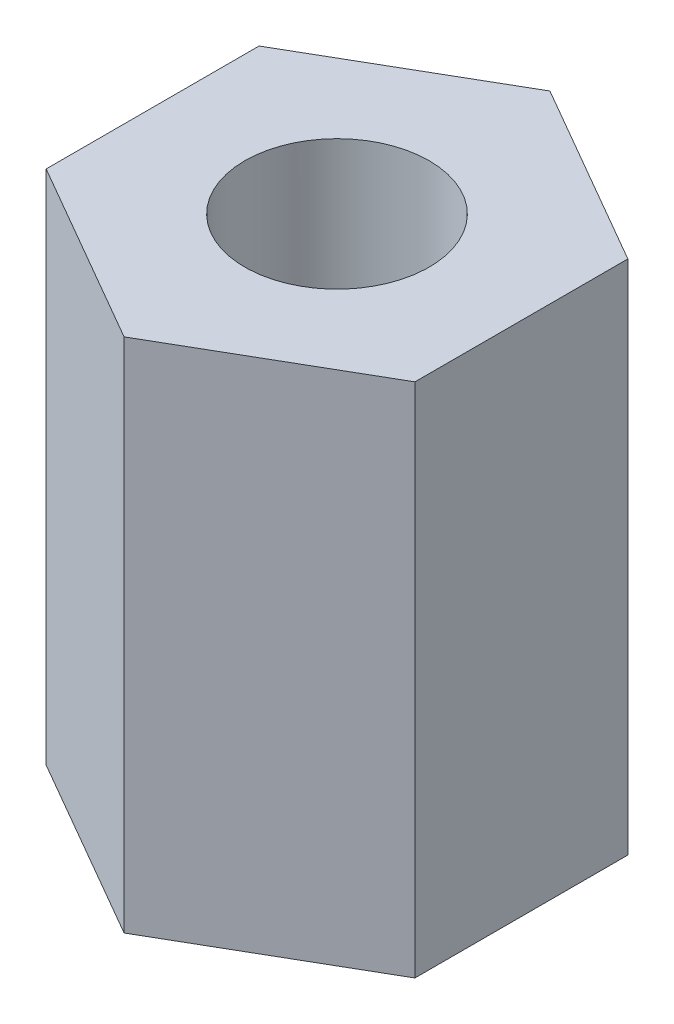
ISO-10303-21;
HEADER;
FILE_DESCRIPTION(('STEP AP214'),'2;1');
FILE_NAME('part.step','',(''),(''),'','','');
FILE_SCHEMA(('AUTOMOTIVE_DESIGN { 1 0 10303 214 1 1 1 1 }'));
ENDSEC;
DATA;
#1=APPLICATION_CONTEXT('core data for automotive mechanical design processes');
#2=APPLICATION_PROTOCOL_DEFINITION('international standard','automotive_design',2000,#1);
#3=PRODUCT_CONTEXT('',#1,'mechanical');
#4=PRODUCT('Part','Part','',(#3));
#5=PRODUCT_RELATED_PRODUCT_CATEGORY('part','',(#4));
#6=PRODUCT_DEFINITION_FORMATION('','',#4);
#7=PRODUCT_DEFINITION_CONTEXT('part definition',#1,'design');
#8=PRODUCT_DEFINITION('design','',#6,#7);
#9=PRODUCT_DEFINITION_SHAPE('','',#8);
#10=(LENGTH_UNIT() NAMED_UNIT(*) SI_UNIT(.MILLI.,.METRE.));
#11=(NAMED_UNIT(*) PLANE_ANGLE_UNIT() SI_UNIT($,.RADIAN.));
#12=(NAMED_UNIT(*) SI_UNIT($,.STERADIAN.) SOLID_ANGLE_UNIT());
#13=UNCERTAINTY_MEASURE_WITH_UNIT(LENGTH_MEASURE(1.E-05),#10,'distance_accuracy_value','');
#14=(GEOMETRIC_REPRESENTATION_CONTEXT(3) GLOBAL_UNCERTAINTY_ASSIGNED_CONTEXT((#13)) GLOBAL_UNIT_ASSIGNED_CONTEXT((#10,
#11,#12)) REPRESENTATION_CONTEXT('',''));
#15=CARTESIAN_POINT('',(0.,0.,0.));
#16=DIRECTION('',(0.,0.,1.));
#17=DIRECTION('',(1.,0.,0.));
#18=AXIS2_PLACEMENT_3D('',#15,#16,#17);
#19=CARTESIAN_POINT('',(2.5,0.,-1.443375672974));
#20=DIRECTION('',(0.500000000000017,0.,-0.866025403784429));
#21=DIRECTION('',(0.,-1.,0.));
#22=AXIS2_PLACEMENT_3D('',#19,#20,#21);
#23=PLANE('',#22);
#24=DIRECTION('',(0.,1.,0.));
#25=VECTOR('',#24,1.);
#26=CARTESIAN_POINT('',(2.50000000001,0.,-1.443375672984));
#27=LINE('',#26,#25);
#28=CARTESIAN_POINT('',(2.5,38.,-1.443375672974));
#29=VERTEX_POINT('',#28);
#30=CARTESIAN_POINT('',(2.5,45.,-1.443375672974));
#31=VERTEX_POINT('',#30);
#32=EDGE_CURVE('E118',#29,#31,#27,.T.);
#33=ORIENTED_EDGE('',*,*,#32,.F.);
#34=DIRECTION('',(-0.866025403784429,0.,-0.500000000000017));
#35=VECTOR('',#34,1.);
#36=CARTESIAN_POINT('',(2.5,38.,-1.443375672974));
#37=LINE('',#36,#35);
#38=CARTESIAN_POINT('',(0.,38.,-2.886751345948));
#39=VERTEX_POINT('',#38);
#40=EDGE_CURVE('E128',#29,#39,#37,.T.);
#41=ORIENTED_EDGE('',*,*,#40,.T.);
#42=DIRECTION('',(0.,1.,0.));
#43=VECTOR('',#42,1.);
#44=CARTESIAN_POINT('',(0.,0.,-2.886751345958));
#45=LINE('',#44,#43);
#46=CARTESIAN_POINT('',(0.,45.,-2.886751345948));
#47=VERTEX_POINT('',#46);
#48=EDGE_CURVE('E47',#39,#47,#45,.T.);
#49=ORIENTED_EDGE('',*,*,#48,.T.);
#50=DIRECTION('',(-0.866025403783795,0.,-0.500000000001115));
#51=VECTOR('',#50,1.);
#52=CARTESIAN_POINT('',(2.50000000001,45.00000000001,-1.443375672984));
#53=LINE('',#52,#51);
#54=EDGE_CURVE('E120',#31,#47,#53,.T.);
#55=ORIENTED_EDGE('',*,*,#54,.F.);
#56=EDGE_LOOP('',(#33,#41,#49,#55));
#57=FACE_BOUND('',#56,.T.);
#58=ADVANCED_FACE('F40',(#57),#23,.T.);
#59=CARTESIAN_POINT('',(2.5,0.,1.443375672974));
#60=DIRECTION('',(1.,0.,0.));
#61=DIRECTION('',(0.,1.,0.));
#62=AXIS2_PLACEMENT_3D('',#59,#60,#61);
#63=PLANE('',#62);
#64=DIRECTION('',(0.,1.,0.));
#65=VECTOR('',#64,1.);
#66=CARTESIAN_POINT('',(2.50000000001,0.,1.443375672984));
#67=LINE('',#66,#65);
#68=CARTESIAN_POINT('',(2.5,38.,1.44337567297387));
#69=VERTEX_POINT('',#68);
#70=CARTESIAN_POINT('',(2.5,45.,1.443375672974));
#71=VERTEX_POINT('',#70);
#72=EDGE_CURVE('E107',#69,#71,#67,.T.);
#73=ORIENTED_EDGE('',*,*,#72,.F.);
#74=DIRECTION('',(0.,0.,-1.));
#75=VECTOR('',#74,1.);
#76=CARTESIAN_POINT('',(2.5,38.,1.443375672974));
#77=LINE('',#76,#75);
#78=EDGE_CURVE('E100',#69,#29,#77,.T.);
#79=ORIENTED_EDGE('',*,*,#78,.T.);
#80=ORIENTED_EDGE('',*,*,#32,.T.);
#81=DIRECTION('',(0.,0.,-1.));
#82=VECTOR('',#81,1.);
#83=CARTESIAN_POINT('',(2.50000000001,45.00000000001,1.443375672984));
#84=LINE('',#83,#82);
#85=EDGE_CURVE('E110',#71,#31,#84,.T.);
#86=ORIENTED_EDGE('',*,*,#85,.F.);
#87=EDGE_LOOP('',(#73,#79,#80,#86));
#88=FACE_BOUND('',#87,.T.);
#89=ADVANCED_FACE('F132',(#88),#63,.T.);
#90=CARTESIAN_POINT('',(0.,0.,-2.886751345948));
#91=DIRECTION('',(-0.500000000000017,0.,-0.866025403784429));
#92=DIRECTION('',(-0.866025403784429,0.,0.500000000000017));
#93=AXIS2_PLACEMENT_3D('',#90,#91,#92);
#94=PLANE('',#93);
#95=ORIENTED_EDGE('',*,*,#48,.F.);
#96=DIRECTION('',(-0.866025403784429,0.,0.500000000000017));
#97=VECTOR('',#96,1.);
#98=CARTESIAN_POINT('',(0.,38.,-2.886751345948));
#99=LINE('',#98,#97);
#100=CARTESIAN_POINT('',(-2.5,38.,-1.443375672974));
#101=VERTEX_POINT('',#100);
#102=EDGE_CURVE('E92',#39,#101,#99,.T.);
#103=ORIENTED_EDGE('',*,*,#102,.T.);
#104=DIRECTION('',(0.,1.,0.));
#105=VECTOR('',#104,1.);
#106=CARTESIAN_POINT('',(-2.50000000001,0.,-1.443375672984));
#107=LINE('',#106,#105);
#108=CARTESIAN_POINT('',(-2.5,45.,-1.443375672974));
#109=VERTEX_POINT('',#108);
#110=EDGE_CURVE('E98',#101,#109,#107,.T.);
#111=ORIENTED_EDGE('',*,*,#110,.T.);
#112=DIRECTION('',(-0.866025403783795,0.,0.500000000001115));
#113=VECTOR('',#112,1.);
#114=CARTESIAN_POINT('',(0.,45.00000000001,-2.886751345958));
#115=LINE('',#114,#113);
#116=EDGE_CURVE('E108',#47,#109,#115,.T.);
#117=ORIENTED_EDGE('',*,*,#116,.F.);
#118=EDGE_LOOP('',(#95,#103,#111,#117));
#119=FACE_BOUND('',#118,.T.);
#120=ADVANCED_FACE('F97',(#119),#94,.T.);
#121=CARTESIAN_POINT('',(0.,0.,2.886751345948));
#122=DIRECTION('',(0.500000000000017,0.,0.866025403784429));
#123=DIRECTION('',(0.,-1.,0.));
#124=AXIS2_PLACEMENT_3D('',#121,#122,#123);
#125=PLANE('',#124);
#126=DIRECTION('',(0.,1.,0.));
#127=VECTOR('',#126,1.);
#128=CARTESIAN_POINT('',(0.,0.,2.886751345958));
#129=LINE('',#128,#127);
#130=CARTESIAN_POINT('',(0.,38.,2.88675134594813));
#131=VERTEX_POINT('',#130);
#132=CARTESIAN_POINT('',(0.,45.,2.886751345948));
#133=VERTEX_POINT('',#132);
#134=EDGE_CURVE('E150',#131,#133,#129,.T.);
#135=ORIENTED_EDGE('',*,*,#134,.F.);
#136=DIRECTION('',(0.866025403784429,0.,-0.500000000000017));
#137=VECTOR('',#136,1.);
#138=CARTESIAN_POINT('',(0.,38.,2.886751345948));
#139=LINE('',#138,#137);
#140=EDGE_CURVE('E101',#131,#69,#139,.T.);
#141=ORIENTED_EDGE('',*,*,#140,.T.);
#142=ORIENTED_EDGE('',*,*,#72,.T.);
#143=DIRECTION('',(0.866025403783795,0.,-0.500000000001115));
#144=VECTOR('',#143,1.);
#145=CARTESIAN_POINT('',(0.,45.00000000001,2.886751345958));
#146=LINE('',#145,#144);
#147=EDGE_CURVE('E112',#133,#71,#146,.T.);
#148=ORIENTED_EDGE('',*,*,#147,.F.);
#149=EDGE_LOOP('',(#135,#141,#142,#148));
#150=FACE_BOUND('',#149,.T.);
#151=ADVANCED_FACE('F155',(#150),#125,.T.);
#152=CARTESIAN_POINT('',(-2.5,0.,1.443375672974));
#153=DIRECTION('',(-0.500000000000017,0.,0.866025403784429));
#154=DIRECTION('',(0.,1.,0.));
#155=AXIS2_PLACEMENT_3D('',#152,#153,#154);
#156=PLANE('',#155);
#157=DIRECTION('',(0.,1.,0.));
#158=VECTOR('',#157,1.);
#159=CARTESIAN_POINT('',(-2.50000000001,0.,1.443375672984));
#160=LINE('',#159,#158);
#161=CARTESIAN_POINT('',(-2.50000000001,38.,1.443375672984));
#162=VERTEX_POINT('',#161);
#163=CARTESIAN_POINT('',(-2.5,45.,1.443375672974));
#164=VERTEX_POINT('',#163);
#165=EDGE_CURVE('E145',#162,#164,#160,.T.);
#166=ORIENTED_EDGE('',*,*,#165,.F.);
#167=DIRECTION('',(0.866025403784429,0.,0.500000000000017));
#168=VECTOR('',#167,1.);
#169=CARTESIAN_POINT('',(-2.5,38.,1.443375672974));
#170=LINE('',#169,#168);
#171=EDGE_CURVE('E54',#162,#131,#170,.T.);
#172=ORIENTED_EDGE('',*,*,#171,.T.);
#173=ORIENTED_EDGE('',*,*,#134,.T.);
#174=DIRECTION('',(0.866025403783795,0.,0.500000000001115));
#175=VECTOR('',#174,1.);
#176=CARTESIAN_POINT('',(-2.50000000001,45.00000000001,1.443375672984));
#177=LINE('',#176,#175);
#178=EDGE_CURVE('E147',#164,#133,#177,.T.);
#179=ORIENTED_EDGE('',*,*,#178,.F.);
#180=EDGE_LOOP('',(#166,#172,#173,#179));
#181=FACE_BOUND('',#180,.T.);
#182=ADVANCED_FACE('F158',(#181),#156,.T.);
#183=CARTESIAN_POINT('',(0.,33.71137043753,0.));
#184=DIRECTION('',(0.,-1.,0.));
#185=DIRECTION('',(1.,0.,0.));
#186=AXIS2_PLACEMENT_3D('',#183,#184,#185);
#187=CYLINDRICAL_SURFACE('',#186,1.25);
#188=CARTESIAN_POINT('',(0.,45.00000000001,0.));
#189=DIRECTION('',(0.,1.,0.));
#190=DIRECTION('',(-1.,0.,0.));
#191=AXIS2_PLACEMENT_3D('',#188,#189,#190);
#192=CIRCLE('',#191,1.25);
#193=CARTESIAN_POINT('',(-1.25,45.00000000001,0.));
#194=VERTEX_POINT('',#193);
#195=EDGE_CURVE('E141',#194,#194,#192,.T.);
#196=ORIENTED_EDGE('',*,*,#195,.T.);
#197=EDGE_LOOP('',(#196));
#198=FACE_BOUND('',#197,.T.);
#199=CARTESIAN_POINT('',(0.,38.,0.));
#200=DIRECTION('',(0.,-1.,0.));
#201=DIRECTION('',(0.,0.,-1.));
#202=AXIS2_PLACEMENT_3D('',#199,#200,#201);
#203=CIRCLE('',#202,1.25);
#204=CARTESIAN_POINT('',(0.,38.,-1.25));
#205=VERTEX_POINT('',#204);
#206=EDGE_CURVE('E135',#205,#205,#203,.F.);
#207=ORIENTED_EDGE('',*,*,#206,.F.);
#208=EDGE_LOOP('',(#207));
#209=FACE_BOUND('',#208,.T.);
#210=ADVANCED_FACE('F160',(#198,#209),#187,.F.);
#211=CARTESIAN_POINT('',(-2.5,0.,-1.443375672974));
#212=DIRECTION('',(-1.,0.,0.));
#213=DIRECTION('',(0.,0.,1.));
#214=AXIS2_PLACEMENT_3D('',#211,#212,#213);
#215=PLANE('',#214);
#216=ORIENTED_EDGE('',*,*,#110,.F.);
#217=DIRECTION('',(0.,0.,1.));
#218=VECTOR('',#217,1.);
#219=CARTESIAN_POINT('',(-2.5,38.,-1.443375672974));
#220=LINE('',#219,#218);
#221=EDGE_CURVE('E11',#101,#162,#220,.T.);
#222=ORIENTED_EDGE('',*,*,#221,.T.);
#223=ORIENTED_EDGE('',*,*,#165,.T.);
#224=DIRECTION('',(0.,0.,1.));
#225=VECTOR('',#224,1.);
#226=CARTESIAN_POINT('',(-2.50000000001,45.00000000001,-1.443375672984));
#227=LINE('',#226,#225);
#228=EDGE_CURVE('E106',#109,#164,#227,.T.);
#229=ORIENTED_EDGE('',*,*,#228,.F.);
#230=EDGE_LOOP('',(#216,#222,#223,#229));
#231=FACE_BOUND('',#230,.T.);
#232=ADVANCED_FACE('F104',(#231),#215,.T.);
#233=CARTESIAN_POINT('',(0.,45.,0.));
#234=DIRECTION('',(0.,1.,0.));
#235=DIRECTION('',(1.,0.,0.));
#236=AXIS2_PLACEMENT_3D('',#233,#234,#235);
#237=PLANE('',#236);
#238=ORIENTED_EDGE('',*,*,#228,.T.);
#239=ORIENTED_EDGE('',*,*,#178,.T.);
#240=ORIENTED_EDGE('',*,*,#147,.T.);
#241=ORIENTED_EDGE('',*,*,#85,.T.);
#242=ORIENTED_EDGE('',*,*,#54,.T.);
#243=ORIENTED_EDGE('',*,*,#116,.T.);
#244=EDGE_LOOP('',(#238,#239,#240,#241,#242,#243));
#245=FACE_BOUND('',#244,.T.);
#246=ORIENTED_EDGE('',*,*,#195,.F.);
#247=EDGE_LOOP('',(#246));
#248=FACE_BOUND('',#247,.T.);
#249=ADVANCED_FACE('F123',(#245,#248),#237,.T.);
#250=CARTESIAN_POINT('',(0.,38.,0.));
#251=DIRECTION('',(0.,-1.,0.));
#252=DIRECTION('',(0.,0.,-1.));
#253=AXIS2_PLACEMENT_3D('',#250,#251,#252);
#254=PLANE('',#253);
#255=ORIENTED_EDGE('',*,*,#78,.F.);
#256=ORIENTED_EDGE('',*,*,#140,.F.);
#257=ORIENTED_EDGE('',*,*,#171,.F.);
#258=ORIENTED_EDGE('',*,*,#221,.F.);
#259=ORIENTED_EDGE('',*,*,#102,.F.);
#260=ORIENTED_EDGE('',*,*,#40,.F.);
#261=EDGE_LOOP('',(#255,#256,#257,#258,#259,#260));
#262=FACE_BOUND('',#261,.T.);
#263=ORIENTED_EDGE('',*,*,#206,.T.);
#264=EDGE_LOOP('',(#263));
#265=FACE_BOUND('',#264,.T.);
#266=ADVANCED_FACE('F90',(#262,#265),#254,.T.);
#267=CLOSED_SHELL('',(#58,#89,#120,#151,#182,#210,#232,#249,#266));
#268=MANIFOLD_SOLID_BREP('B2',#267);
#269=ADVANCED_BREP_SHAPE_REPRESENTATION('',(#18,#268),#14);
#270=SHAPE_DEFINITION_REPRESENTATION(#9,#269);
ENDSEC;
END-ISO-10303-21;
